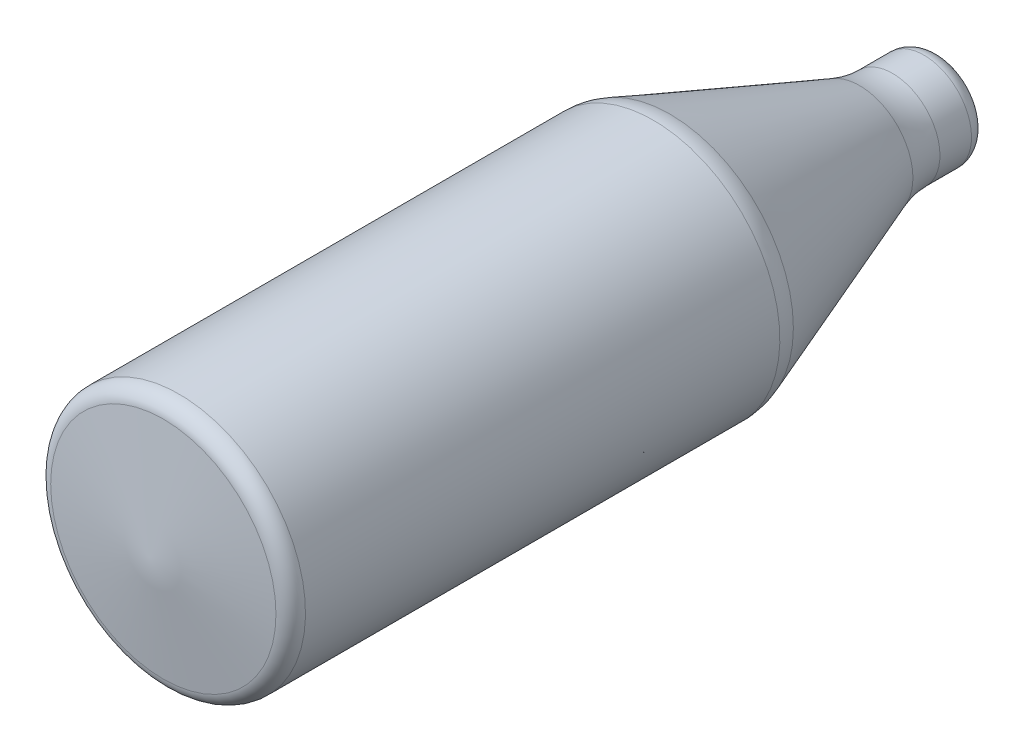
ISO-10303-21;
HEADER;
FILE_DESCRIPTION(('STEP AP214'),'2;1');
FILE_NAME('part.step','',(''),(''),'','','');
FILE_SCHEMA(('AUTOMOTIVE_DESIGN { 1 0 10303 214 1 1 1 1 }'));
ENDSEC;
DATA;
#1=APPLICATION_CONTEXT('core data for automotive mechanical design processes');
#2=APPLICATION_PROTOCOL_DEFINITION('international standard','automotive_design',2000,#1);
#3=PRODUCT_CONTEXT('',#1,'mechanical');
#4=PRODUCT('Part','Part','',(#3));
#5=PRODUCT_RELATED_PRODUCT_CATEGORY('part','',(#4));
#6=PRODUCT_DEFINITION_FORMATION('','',#4);
#7=PRODUCT_DEFINITION_CONTEXT('part definition',#1,'design');
#8=PRODUCT_DEFINITION('design','',#6,#7);
#9=PRODUCT_DEFINITION_SHAPE('','',#8);
#10=(LENGTH_UNIT() NAMED_UNIT(*) SI_UNIT(.MILLI.,.METRE.));
#11=(NAMED_UNIT(*) PLANE_ANGLE_UNIT() SI_UNIT($,.RADIAN.));
#12=(NAMED_UNIT(*) SI_UNIT($,.STERADIAN.) SOLID_ANGLE_UNIT());
#13=UNCERTAINTY_MEASURE_WITH_UNIT(LENGTH_MEASURE(1.E-05),#10,'distance_accuracy_value','');
#14=(GEOMETRIC_REPRESENTATION_CONTEXT(3) GLOBAL_UNCERTAINTY_ASSIGNED_CONTEXT((#13)) GLOBAL_UNIT_ASSIGNED_CONTEXT((#10,
#11,#12)) REPRESENTATION_CONTEXT('',''));
#15=CARTESIAN_POINT('',(0.,0.,0.));
#16=DIRECTION('',(0.,0.,1.));
#17=DIRECTION('',(1.,0.,0.));
#18=AXIS2_PLACEMENT_3D('',#15,#16,#17);
#19=CARTESIAN_POINT('',(0.,0.,179.976081716261));
#20=DIRECTION('',(0.,0.,-1.));
#21=DIRECTION('',(0.,1.,0.));
#22=AXIS2_PLACEMENT_3D('',#19,#20,#21);
#23=CONICAL_SURFACE('',#22,0.,1.44673805081811);
#24=CARTESIAN_POINT('',(0.,0.,171.092873276531));
#25=DIRECTION('',(0.,0.,1.));
#26=DIRECTION('',(0.,-1.,0.));
#27=AXIS2_PLACEMENT_3D('',#24,#25,#26);
#28=CIRCLE('',#27,71.2374030186081);
#29=CARTESIAN_POINT('',(0.,-71.2374030186081,171.092873276531));
#30=VERTEX_POINT('',#29);
#31=EDGE_CURVE('E61',#30,#30,#28,.T.);
#32=ORIENTED_EDGE('',*,*,#31,.T.);
#33=EDGE_LOOP('',(#32));
#34=FACE_BOUND('',#33,.T.);
#35=CARTESIAN_POINT('',(0.,0.,179.976081716261));
#36=VERTEX_POINT('',#35);
#37=VERTEX_LOOP('',#36);
#38=FACE_BOUND('',#37,.T.);
#39=ADVANCED_FACE('F36',(#34,#38),#23,.T.);
#40=CARTESIAN_POINT('',(0.,0.,-320.023918283739));
#41=DIRECTION('',(0.,0.,-1.));
#42=DIRECTION('',(0.,1.,0.));
#43=AXIS2_PLACEMENT_3D('',#40,#41,#42);
#44=PLANE('',#43);
#45=CARTESIAN_POINT('',(0.,0.,-320.023918283739));
#46=DIRECTION('',(0.,0.,1.));
#47=DIRECTION('',(0.,-1.,0.));
#48=AXIS2_PLACEMENT_3D('',#45,#46,#47);
#49=CIRCLE('',#48,20.);
#50=CARTESIAN_POINT('',(0.,-20.,-320.023918283739));
#51=VERTEX_POINT('',#50);
#52=EDGE_CURVE('E83',#51,#51,#49,.T.);
#53=ORIENTED_EDGE('',*,*,#52,.F.);
#54=EDGE_LOOP('',(#53));
#55=FACE_BOUND('',#54,.T.);
#56=ADVANCED_FACE('F51',(#55),#44,.T.);
#57=CARTESIAN_POINT('',(0.,0.,-310.023918283739));
#58=DIRECTION('',(0.,0.,1.));
#59=DIRECTION('',(0.,-1.,0.));
#60=AXIS2_PLACEMENT_3D('',#57,#58,#59);
#61=TOROIDAL_SURFACE('',#60,20.,10.);
#62=CARTESIAN_POINT('',(0.,0.,-310.023918283739));
#63=DIRECTION('',(0.,0.,1.));
#64=DIRECTION('',(0.,-1.,0.));
#65=AXIS2_PLACEMENT_3D('',#62,#63,#64);
#66=CIRCLE('',#65,30.);
#67=CARTESIAN_POINT('',(0.,-30.,-310.023918283739));
#68=VERTEX_POINT('',#67);
#69=EDGE_CURVE('E80',#68,#68,#66,.T.);
#70=ORIENTED_EDGE('',*,*,#69,.F.);
#71=EDGE_LOOP('',(#70));
#72=FACE_BOUND('',#71,.T.);
#73=ORIENTED_EDGE('',*,*,#52,.T.);
#74=EDGE_LOOP('',(#73));
#75=FACE_BOUND('',#74,.T.);
#76=ADVANCED_FACE('F56',(#72,#75),#61,.T.);
#77=CARTESIAN_POINT('',(0.,0.,179.976081716261));
#78=DIRECTION('',(0.,0.,1.));
#79=DIRECTION('',(0.,-1.,0.));
#80=AXIS2_PLACEMENT_3D('',#77,#78,#79);
#81=CYLINDRICAL_SURFACE('',#80,30.);
#82=ORIENTED_EDGE('',*,*,#69,.T.);
#83=EDGE_LOOP('',(#82));
#84=FACE_BOUND('',#83,.T.);
#85=CARTESIAN_POINT('',(0.,0.,-290.064881333574));
#86=DIRECTION('',(0.,0.,1.));
#87=DIRECTION('',(0.,-1.,0.));
#88=AXIS2_PLACEMENT_3D('',#85,#86,#87);
#89=CIRCLE('',#88,30.);
#90=CARTESIAN_POINT('',(0.,-30.,-290.064881333574));
#91=VERTEX_POINT('',#90);
#92=EDGE_CURVE('E77',#91,#91,#89,.T.);
#93=ORIENTED_EDGE('',*,*,#92,.F.);
#94=EDGE_LOOP('',(#93));
#95=FACE_BOUND('',#94,.T.);
#96=ADVANCED_FACE('F136',(#84,#95),#81,.T.);
#97=CARTESIAN_POINT('',(0.,0.,-290.064881333574));
#98=DIRECTION('',(0.,0.,1.));
#99=DIRECTION('',(0.,-1.,0.));
#100=AXIS2_PLACEMENT_3D('',#97,#98,#99);
#101=TOROIDAL_SURFACE('',#100,90.,60.);
#102=ORIENTED_EDGE('',*,*,#92,.T.);
#103=EDGE_LOOP('',(#102));
#104=FACE_BOUND('',#103,.T.);
#105=CARTESIAN_POINT('',(0.,0.,-269.241809169779));
#106=DIRECTION('',(0.,0.,1.));
#107=DIRECTION('',(0.,-1.,0.));
#108=AXIS2_PLACEMENT_3D('',#105,#106,#107);
#109=CIRCLE('',#108,33.7292290290831);
#110=CARTESIAN_POINT('',(0.,-33.7292290290831,-269.241809169779));
#111=VERTEX_POINT('',#110);
#112=EDGE_CURVE('E74',#111,#111,#109,.T.);
#113=ORIENTED_EDGE('',*,*,#112,.F.);
#114=EDGE_LOOP('',(#113));
#115=FACE_BOUND('',#114,.T.);
#116=ADVANCED_FACE('F140',(#104,#115),#101,.F.);
#117=CARTESIAN_POINT('',(0.,0.,-149.241809169779));
#118=DIRECTION('',(0.,0.,1.));
#119=DIRECTION('',(0.,-1.,0.));
#120=AXIS2_PLACEMENT_3D('',#117,#118,#119);
#121=CONICAL_SURFACE('',#120,78.1353854854585,0.354425044417225);
#122=ORIENTED_EDGE('',*,*,#112,.T.);
#123=EDGE_LOOP('',(#122));
#124=FACE_BOUND('',#123,.T.);
#125=CARTESIAN_POINT('',(0.,0.,-149.241809169779));
#126=DIRECTION('',(0.,0.,1.));
#127=DIRECTION('',(0.,-1.,0.));
#128=AXIS2_PLACEMENT_3D('',#125,#126,#127);
#129=CIRCLE('',#128,78.1353854854585);
#130=CARTESIAN_POINT('',(0.,-78.1353854854585,-149.241809169779));
#131=VERTEX_POINT('',#130);
#132=EDGE_CURVE('E71',#131,#131,#129,.T.);
#133=ORIENTED_EDGE('',*,*,#132,.F.);
#134=EDGE_LOOP('',(#133));
#135=FACE_BOUND('',#134,.T.);
#136=ADVANCED_FACE('F144',(#124,#135),#121,.T.);
#137=CARTESIAN_POINT('',(0.,0.,-138.830273087881));
#138=DIRECTION('',(0.,0.,1.));
#139=DIRECTION('',(0.,-1.,0.));
#140=AXIS2_PLACEMENT_3D('',#137,#138,#139);
#141=TOROIDAL_SURFACE('',#140,50.,30.);
#142=CARTESIAN_POINT('',(0.,0.,-138.830273087881));
#143=DIRECTION('',(0.,0.,1.));
#144=DIRECTION('',(0.,-1.,0.));
#145=AXIS2_PLACEMENT_3D('',#142,#143,#144);
#146=CIRCLE('',#145,80.);
#147=CARTESIAN_POINT('',(0.,-80.,-138.830273087881));
#148=VERTEX_POINT('',#147);
#149=EDGE_CURVE('E66',#148,#148,#146,.T.);
#150=ORIENTED_EDGE('',*,*,#149,.F.);
#151=EDGE_LOOP('',(#150));
#152=FACE_BOUND('',#151,.T.);
#153=ORIENTED_EDGE('',*,*,#132,.T.);
#154=EDGE_LOOP('',(#153));
#155=FACE_BOUND('',#154,.T.);
#156=ADVANCED_FACE('F148',(#152,#155),#141,.T.);
#157=CARTESIAN_POINT('',(0.,0.,179.976081716261));
#158=DIRECTION('',(0.,0.,1.));
#159=DIRECTION('',(0.,-1.,0.));
#160=AXIS2_PLACEMENT_3D('',#157,#158,#159);
#161=CYLINDRICAL_SURFACE('',#160,80.);
#162=ORIENTED_EDGE('',*,*,#149,.T.);
#163=EDGE_LOOP('',(#162));
#164=FACE_BOUND('',#163,.T.);
#165=CARTESIAN_POINT('',(0.,0.,161.169726912119));
#166=DIRECTION('',(0.,0.,1.));
#167=DIRECTION('',(0.,-1.,0.));
#168=AXIS2_PLACEMENT_3D('',#165,#166,#167);
#169=CIRCLE('',#168,80.);
#170=CARTESIAN_POINT('',(0.,-80.,161.169726912119));
#171=VERTEX_POINT('',#170);
#172=EDGE_CURVE('E63',#171,#171,#169,.T.);
#173=ORIENTED_EDGE('',*,*,#172,.F.);
#174=EDGE_LOOP('',(#173));
#175=FACE_BOUND('',#174,.T.);
#176=ADVANCED_FACE('F152',(#164,#175),#161,.T.);
#177=CARTESIAN_POINT('',(0.,0.,161.169726912119));
#178=DIRECTION('',(0.,0.,1.));
#179=DIRECTION('',(0.,-1.,0.));
#180=AXIS2_PLACEMENT_3D('',#177,#178,#179);
#181=TOROIDAL_SURFACE('',#180,70.,10.);
#182=ORIENTED_EDGE('',*,*,#172,.T.);
#183=EDGE_LOOP('',(#182));
#184=FACE_BOUND('',#183,.T.);
#185=ORIENTED_EDGE('',*,*,#31,.F.);
#186=EDGE_LOOP('',(#185));
#187=FACE_BOUND('',#186,.T.);
#188=ADVANCED_FACE('F156',(#184,#187),#181,.T.);
#189=CLOSED_SHELL('',(#39,#56,#76,#96,#116,#136,#156,#176,#188));
#190=CARTESIAN_POINT('',(0.,0.,169.89863285804));
#191=DIRECTION('',(0.,0.,-1.));
#192=DIRECTION('',(0.,1.,0.));
#193=AXIS2_PLACEMENT_3D('',#190,#191,#192);
#194=CONICAL_SURFACE('',#193,0.,1.44673805081811);
#195=CARTESIAN_POINT('',(0.,0.,161.169726912119));
#196=DIRECTION('',(0.,0.,1.));
#197=DIRECTION('',(0.,-1.,0.));
#198=AXIS2_PLACEMENT_3D('',#195,#196,#197);
#199=CIRCLE('',#198,70.);
#200=CARTESIAN_POINT('',(0.,-70.,161.169726912119));
#201=VERTEX_POINT('',#200);
#202=EDGE_CURVE('E11',#201,#201,#199,.T.);
#203=ORIENTED_EDGE('',*,*,#202,.F.);
#204=EDGE_LOOP('',(#203));
#205=FACE_BOUND('',#204,.T.);
#206=CARTESIAN_POINT('',(0.,0.,169.89863285804));
#207=VERTEX_POINT('',#206);
#208=VERTEX_LOOP('',#207);
#209=FACE_BOUND('',#208,.T.);
#210=ADVANCED_FACE('F106',(#205,#209),#194,.F.);
#211=CARTESIAN_POINT('',(0.,0.,179.976081716261));
#212=DIRECTION('',(0.,0.,1.));
#213=DIRECTION('',(0.,-1.,0.));
#214=AXIS2_PLACEMENT_3D('',#211,#212,#213);
#215=CYLINDRICAL_SURFACE('',#214,70.);
#216=CARTESIAN_POINT('',(0.,0.,-138.830273087881));
#217=DIRECTION('',(0.,0.,1.));
#218=DIRECTION('',(0.,-1.,0.));
#219=AXIS2_PLACEMENT_3D('',#216,#217,#218);
#220=CIRCLE('',#219,70.);
#221=CARTESIAN_POINT('',(0.,-70.,-138.830273087881));
#222=VERTEX_POINT('',#221);
#223=EDGE_CURVE('E44',#222,#222,#220,.T.);
#224=ORIENTED_EDGE('',*,*,#223,.F.);
#225=EDGE_LOOP('',(#224));
#226=FACE_BOUND('',#225,.T.);
#227=ORIENTED_EDGE('',*,*,#202,.T.);
#228=EDGE_LOOP('',(#227));
#229=FACE_BOUND('',#228,.T.);
#230=ADVANCED_FACE('F103',(#226,#229),#215,.F.);
#231=CARTESIAN_POINT('',(0.,0.,-138.830273087881));
#232=DIRECTION('',(0.,0.,1.));
#233=DIRECTION('',(0.,-1.,0.));
#234=AXIS2_PLACEMENT_3D('',#231,#232,#233);
#235=TOROIDAL_SURFACE('',#234,50.,20.);
#236=ORIENTED_EDGE('',*,*,#223,.T.);
#237=EDGE_LOOP('',(#236));
#238=FACE_BOUND('',#237,.T.);
#239=CARTESIAN_POINT('',(0.,0.,-145.77129714248));
#240=DIRECTION('',(0.,0.,1.));
#241=DIRECTION('',(0.,-1.,0.));
#242=AXIS2_PLACEMENT_3D('',#239,#240,#241);
#243=CIRCLE('',#242,68.7569236569723);
#244=CARTESIAN_POINT('',(0.,-68.7569236569723,-145.77129714248));
#245=VERTEX_POINT('',#244);
#246=EDGE_CURVE('E95',#245,#245,#243,.T.);
#247=ORIENTED_EDGE('',*,*,#246,.F.);
#248=EDGE_LOOP('',(#247));
#249=FACE_BOUND('',#248,.T.);
#250=ADVANCED_FACE('F100',(#238,#249),#235,.F.);
#251=CARTESIAN_POINT('',(0.,0.,-145.77129714248));
#252=DIRECTION('',(0.,0.,1.));
#253=DIRECTION('',(0.,-1.,0.));
#254=AXIS2_PLACEMENT_3D('',#251,#252,#253);
#255=CONICAL_SURFACE('',#254,68.7569236569723,0.354425044417225);
#256=CARTESIAN_POINT('',(0.,0.,-265.77129714248));
#257=DIRECTION('',(0.,0.,1.));
#258=DIRECTION('',(0.,-1.,0.));
#259=AXIS2_PLACEMENT_3D('',#256,#257,#258);
#260=CIRCLE('',#259,24.3507672005969);
#261=CARTESIAN_POINT('',(0.,-24.3507672005969,-265.77129714248));
#262=VERTEX_POINT('',#261);
#263=EDGE_CURVE('E92',#262,#262,#260,.T.);
#264=ORIENTED_EDGE('',*,*,#263,.F.);
#265=EDGE_LOOP('',(#264));
#266=FACE_BOUND('',#265,.T.);
#267=ORIENTED_EDGE('',*,*,#246,.T.);
#268=EDGE_LOOP('',(#267));
#269=FACE_BOUND('',#268,.T.);
#270=ADVANCED_FACE('F118',(#266,#269),#255,.F.);
#271=CARTESIAN_POINT('',(0.,0.,-290.064881333574));
#272=DIRECTION('',(0.,0.,1.));
#273=DIRECTION('',(0.,-1.,0.));
#274=AXIS2_PLACEMENT_3D('',#271,#272,#273);
#275=TOROIDAL_SURFACE('',#274,90.,70.);
#276=CARTESIAN_POINT('',(0.,0.,-290.064881333574));
#277=DIRECTION('',(0.,0.,1.));
#278=DIRECTION('',(0.,-1.,0.));
#279=AXIS2_PLACEMENT_3D('',#276,#277,#278);
#280=CIRCLE('',#279,20.);
#281=CARTESIAN_POINT('',(0.,-20.,-290.064881333574));
#282=VERTEX_POINT('',#281);
#283=EDGE_CURVE('E89',#282,#282,#280,.T.);
#284=ORIENTED_EDGE('',*,*,#283,.F.);
#285=EDGE_LOOP('',(#284));
#286=FACE_BOUND('',#285,.T.);
#287=ORIENTED_EDGE('',*,*,#263,.T.);
#288=EDGE_LOOP('',(#287));
#289=FACE_BOUND('',#288,.T.);
#290=ADVANCED_FACE('F121',(#286,#289),#275,.T.);
#291=CARTESIAN_POINT('',(0.,0.,179.976081716261));
#292=DIRECTION('',(0.,0.,1.));
#293=DIRECTION('',(0.,-1.,0.));
#294=AXIS2_PLACEMENT_3D('',#291,#292,#293);
#295=CYLINDRICAL_SURFACE('',#294,20.);
#296=CARTESIAN_POINT('',(0.,0.,-310.023918283739));
#297=DIRECTION('',(0.,0.,1.));
#298=DIRECTION('',(0.,-1.,0.));
#299=AXIS2_PLACEMENT_3D('',#296,#297,#298);
#300=CIRCLE('',#299,20.);
#301=CARTESIAN_POINT('',(0.,-20.,-310.023918283739));
#302=VERTEX_POINT('',#301);
#303=EDGE_CURVE('E86',#302,#302,#300,.T.);
#304=ORIENTED_EDGE('',*,*,#303,.F.);
#305=EDGE_LOOP('',(#304));
#306=FACE_BOUND('',#305,.T.);
#307=ORIENTED_EDGE('',*,*,#283,.T.);
#308=EDGE_LOOP('',(#307));
#309=FACE_BOUND('',#308,.T.);
#310=ADVANCED_FACE('F125',(#306,#309),#295,.F.);
#311=CARTESIAN_POINT('',(0.,-8.60489230657787E-13,-310.023918283739));
#312=DIRECTION('',(0.,0.,-1.));
#313=DIRECTION('',(0.,1.,0.));
#314=AXIS2_PLACEMENT_3D('',#311,#312,#313);
#315=PLANE('',#314);
#316=ORIENTED_EDGE('',*,*,#303,.T.);
#317=EDGE_LOOP('',(#316));
#318=FACE_BOUND('',#317,.T.);
#319=ADVANCED_FACE('F129',(#318),#315,.F.);
#320=CLOSED_SHELL('',(#210,#230,#250,#270,#290,#310,#319));
#321=ORIENTED_CLOSED_SHELL('',*,#320,.T.);
#322=BREP_WITH_VOIDS('B2',#189,(#321));
#323=ADVANCED_BREP_SHAPE_REPRESENTATION('',(#18,#322),#14);
#324=SHAPE_DEFINITION_REPRESENTATION(#9,#323);
ENDSEC;
END-ISO-10303-21;
